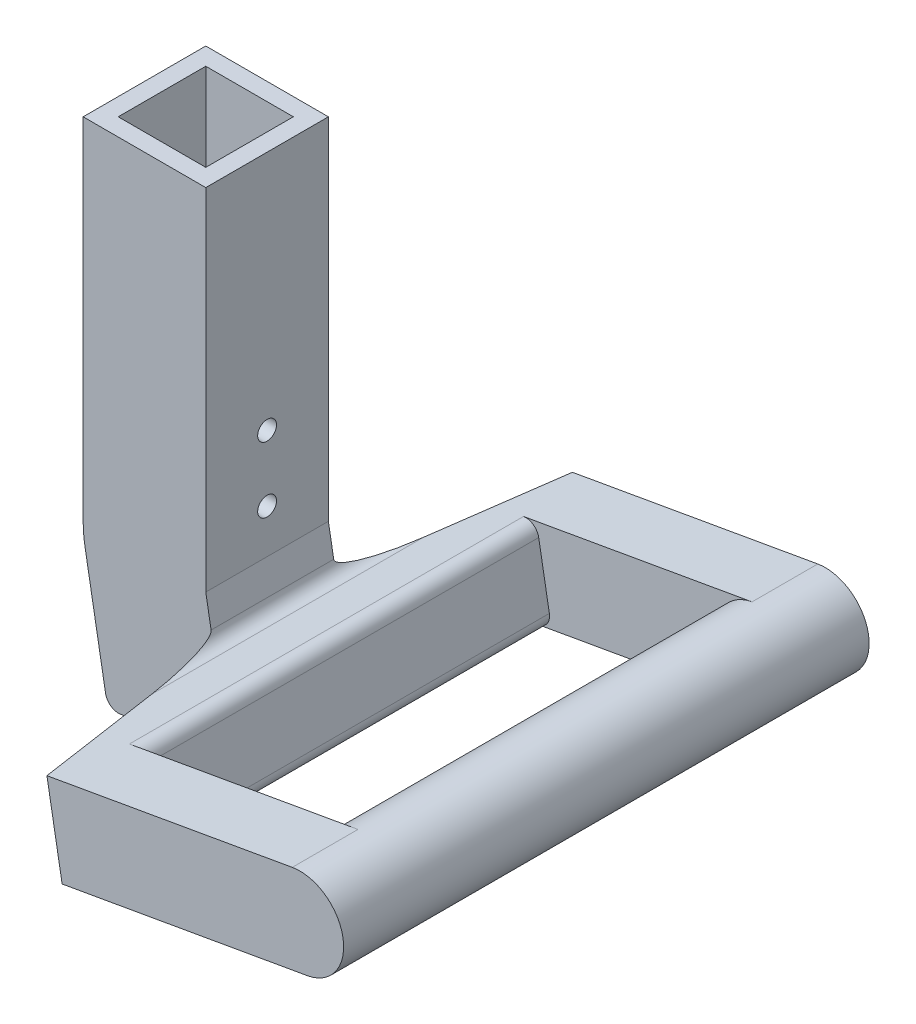
ISO-10303-21;
HEADER;
FILE_DESCRIPTION(('STEP AP214'),'2;1');
FILE_NAME('part.step','',(''),(''),'','','');
FILE_SCHEMA(('AUTOMOTIVE_DESIGN { 1 0 10303 214 1 1 1 1 }'));
ENDSEC;
DATA;
#1=APPLICATION_CONTEXT('core data for automotive mechanical design processes');
#2=APPLICATION_PROTOCOL_DEFINITION('international standard','automotive_design',2000,#1);
#3=PRODUCT_CONTEXT('',#1,'mechanical');
#4=PRODUCT('Part','Part','',(#3));
#5=PRODUCT_RELATED_PRODUCT_CATEGORY('part','',(#4));
#6=PRODUCT_DEFINITION_FORMATION('','',#4);
#7=PRODUCT_DEFINITION_CONTEXT('part definition',#1,'design');
#8=PRODUCT_DEFINITION('design','',#6,#7);
#9=PRODUCT_DEFINITION_SHAPE('','',#8);
#10=(LENGTH_UNIT() NAMED_UNIT(*) SI_UNIT(.MILLI.,.METRE.));
#11=(NAMED_UNIT(*) PLANE_ANGLE_UNIT() SI_UNIT($,.RADIAN.));
#12=(NAMED_UNIT(*) SI_UNIT($,.STERADIAN.) SOLID_ANGLE_UNIT());
#13=UNCERTAINTY_MEASURE_WITH_UNIT(LENGTH_MEASURE(1.E-05),#10,'distance_accuracy_value','');
#14=(GEOMETRIC_REPRESENTATION_CONTEXT(3) GLOBAL_UNCERTAINTY_ASSIGNED_CONTEXT((#13)) GLOBAL_UNIT_ASSIGNED_CONTEXT((#10,
#11,#12)) REPRESENTATION_CONTEXT('',''));
#15=CARTESIAN_POINT('',(0.,0.,0.));
#16=DIRECTION('',(0.,0.,1.));
#17=DIRECTION('',(1.,0.,0.));
#18=AXIS2_PLACEMENT_3D('',#15,#16,#17);
#19=CARTESIAN_POINT('',(0.,30.,0.));
#20=DIRECTION('',(1.,0.,0.));
#21=DIRECTION('',(0.,0.,-1.));
#22=AXIS2_PLACEMENT_3D('',#19,#20,#21);
#23=PLANE('',#22);
#24=CARTESIAN_POINT('',(0.,25.,-10.));
#25=DIRECTION('',(1.,0.,0.));
#26=DIRECTION('',(0.,0.,-1.));
#27=AXIS2_PLACEMENT_3D('',#24,#25,#26);
#28=CIRCLE('',#27,2.15);
#29=CARTESIAN_POINT('',(0.,25.,-12.15));
#30=VERTEX_POINT('',#29);
#31=EDGE_CURVE('E209',#30,#30,#28,.T.);
#32=ORIENTED_EDGE('',*,*,#31,.F.);
#33=EDGE_LOOP('',(#32));
#34=FACE_BOUND('',#33,.T.);
#35=CARTESIAN_POINT('',(0.,10.,-10.));
#36=DIRECTION('',(1.,0.,0.));
#37=DIRECTION('',(0.,0.,-1.));
#38=AXIS2_PLACEMENT_3D('',#35,#36,#37);
#39=CIRCLE('',#38,2.15);
#40=CARTESIAN_POINT('',(0.,10.,-12.15));
#41=VERTEX_POINT('',#40);
#42=EDGE_CURVE('E215',#41,#41,#39,.T.);
#43=ORIENTED_EDGE('',*,*,#42,.F.);
#44=EDGE_LOOP('',(#43));
#45=FACE_BOUND('',#44,.T.);
#46=DIRECTION('',(0.,-1.,0.));
#47=VECTOR('',#46,1.);
#48=CARTESIAN_POINT('',(0.,30.,0.));
#49=LINE('',#48,#47);
#50=CARTESIAN_POINT('',(0.,80.,0.));
#51=VERTEX_POINT('',#50);
#52=CARTESIAN_POINT('',(0.,3.,0.));
#53=VERTEX_POINT('',#52);
#54=EDGE_CURVE('E190',#51,#53,#49,.T.);
#55=ORIENTED_EDGE('',*,*,#54,.T.);
#56=DIRECTION('',(0.,0.,-1.));
#57=VECTOR('',#56,1.);
#58=CARTESIAN_POINT('',(0.,3.,0.));
#59=LINE('',#58,#57);
#60=CARTESIAN_POINT('',(0.,3.,-20.));
#61=VERTEX_POINT('',#60);
#62=EDGE_CURVE('E202',#53,#61,#59,.T.);
#63=ORIENTED_EDGE('',*,*,#62,.T.);
#64=DIRECTION('',(0.,-1.,0.));
#65=VECTOR('',#64,1.);
#66=CARTESIAN_POINT('',(0.,30.,-20.));
#67=LINE('',#66,#65);
#68=CARTESIAN_POINT('',(0.,80.,-20.));
#69=VERTEX_POINT('',#68);
#70=EDGE_CURVE('E199',#69,#61,#67,.T.);
#71=ORIENTED_EDGE('',*,*,#70,.F.);
#72=DIRECTION('',(0.,0.,1.));
#73=VECTOR('',#72,1.);
#74=CARTESIAN_POINT('',(0.,80.,-20.));
#75=LINE('',#74,#73);
#76=EDGE_CURVE('E335',#69,#51,#75,.T.);
#77=ORIENTED_EDGE('',*,*,#76,.T.);
#78=EDGE_LOOP('',(#55,#63,#71,#77));
#79=FACE_BOUND('',#78,.T.);
#80=ADVANCED_FACE('F34',(#34,#45,#79),#23,.T.);
#81=CARTESIAN_POINT('',(0.,30.,0.));
#82=DIRECTION('',(0.,0.,-1.));
#83=DIRECTION('',(-1.,0.,0.));
#84=AXIS2_PLACEMENT_3D('',#81,#82,#83);
#85=PLANE('',#84);
#86=DIRECTION('',(0.,-1.,0.));
#87=VECTOR('',#86,1.);
#88=CARTESIAN_POINT('',(20.,30.,0.));
#89=LINE('',#88,#87);
#90=CARTESIAN_POINT('',(20.,80.,0.));
#91=VERTEX_POINT('',#90);
#92=CARTESIAN_POINT('',(20.,3.,0.));
#93=VERTEX_POINT('',#92);
#94=EDGE_CURVE('E193',#91,#93,#89,.T.);
#95=ORIENTED_EDGE('',*,*,#94,.T.);
#96=DIRECTION('',(-1.,0.,0.));
#97=VECTOR('',#96,1.);
#98=CARTESIAN_POINT('',(0.,3.,0.));
#99=LINE('',#98,#97);
#100=EDGE_CURVE('E205',#93,#53,#99,.T.);
#101=ORIENTED_EDGE('',*,*,#100,.T.);
#102=ORIENTED_EDGE('',*,*,#54,.F.);
#103=DIRECTION('',(1.,0.,0.));
#104=VECTOR('',#103,1.);
#105=CARTESIAN_POINT('',(0.,80.,0.));
#106=LINE('',#105,#104);
#107=EDGE_CURVE('E344',#51,#91,#106,.T.);
#108=ORIENTED_EDGE('',*,*,#107,.T.);
#109=EDGE_LOOP('',(#95,#101,#102,#108));
#110=FACE_BOUND('',#109,.T.);
#111=ADVANCED_FACE('F351',(#110),#85,.T.);
#112=CARTESIAN_POINT('',(20.,30.,0.));
#113=DIRECTION('',(-1.,0.,0.));
#114=DIRECTION('',(0.,0.,1.));
#115=AXIS2_PLACEMENT_3D('',#112,#113,#114);
#116=PLANE('',#115);
#117=CARTESIAN_POINT('',(20.,25.,-10.));
#118=DIRECTION('',(-1.,0.,0.));
#119=DIRECTION('',(0.,0.,1.));
#120=AXIS2_PLACEMENT_3D('',#117,#118,#119);
#121=CIRCLE('',#120,2.15);
#122=CARTESIAN_POINT('',(20.,25.,-7.85));
#123=VERTEX_POINT('',#122);
#124=EDGE_CURVE('E212',#123,#123,#121,.T.);
#125=ORIENTED_EDGE('',*,*,#124,.F.);
#126=EDGE_LOOP('',(#125));
#127=FACE_BOUND('',#126,.T.);
#128=CARTESIAN_POINT('',(20.,10.,-10.));
#129=DIRECTION('',(-1.,0.,0.));
#130=DIRECTION('',(0.,0.,1.));
#131=AXIS2_PLACEMENT_3D('',#128,#129,#130);
#132=CIRCLE('',#131,2.15);
#133=CARTESIAN_POINT('',(20.,10.,-7.85));
#134=VERTEX_POINT('',#133);
#135=EDGE_CURVE('E218',#134,#134,#132,.T.);
#136=ORIENTED_EDGE('',*,*,#135,.F.);
#137=EDGE_LOOP('',(#136));
#138=FACE_BOUND('',#137,.T.);
#139=DIRECTION('',(0.,-1.,0.));
#140=VECTOR('',#139,1.);
#141=CARTESIAN_POINT('',(20.,30.,-20.));
#142=LINE('',#141,#140);
#143=CARTESIAN_POINT('',(20.,80.,-20.));
#144=VERTEX_POINT('',#143);
#145=CARTESIAN_POINT('',(20.,3.,-20.));
#146=VERTEX_POINT('',#145);
#147=EDGE_CURVE('E196',#144,#146,#142,.T.);
#148=ORIENTED_EDGE('',*,*,#147,.T.);
#149=DIRECTION('',(0.,0.,1.));
#150=VECTOR('',#149,1.);
#151=CARTESIAN_POINT('',(20.,3.,0.));
#152=LINE('',#151,#150);
#153=EDGE_CURVE('E83',#146,#93,#152,.T.);
#154=ORIENTED_EDGE('',*,*,#153,.T.);
#155=ORIENTED_EDGE('',*,*,#94,.F.);
#156=DIRECTION('',(0.,0.,-1.));
#157=VECTOR('',#156,1.);
#158=CARTESIAN_POINT('',(20.,80.,0.));
#159=LINE('',#158,#157);
#160=EDGE_CURVE('E341',#91,#144,#159,.T.);
#161=ORIENTED_EDGE('',*,*,#160,.T.);
#162=EDGE_LOOP('',(#148,#154,#155,#161));
#163=FACE_BOUND('',#162,.T.);
#164=ADVANCED_FACE('F362',(#127,#138,#163),#116,.T.);
#165=CARTESIAN_POINT('',(0.,30.,-20.));
#166=DIRECTION('',(0.,0.,1.));
#167=DIRECTION('',(1.,0.,0.));
#168=AXIS2_PLACEMENT_3D('',#165,#166,#167);
#169=PLANE('',#168);
#170=ORIENTED_EDGE('',*,*,#70,.T.);
#171=DIRECTION('',(1.,0.,0.));
#172=VECTOR('',#171,1.);
#173=CARTESIAN_POINT('',(0.,3.,-20.));
#174=LINE('',#173,#172);
#175=EDGE_CURVE('E170',#61,#146,#174,.T.);
#176=ORIENTED_EDGE('',*,*,#175,.T.);
#177=ORIENTED_EDGE('',*,*,#147,.F.);
#178=DIRECTION('',(-1.,0.,0.));
#179=VECTOR('',#178,1.);
#180=CARTESIAN_POINT('',(20.,80.,-20.));
#181=LINE('',#180,#179);
#182=EDGE_CURVE('E338',#144,#69,#181,.T.);
#183=ORIENTED_EDGE('',*,*,#182,.T.);
#184=EDGE_LOOP('',(#170,#176,#177,#183));
#185=FACE_BOUND('',#184,.T.);
#186=ADVANCED_FACE('F434',(#185),#169,.T.);
#187=CARTESIAN_POINT('',(-4.,30.,4.));
#188=DIRECTION('',(1.,0.,0.));
#189=DIRECTION('',(0.,0.,-1.));
#190=AXIS2_PLACEMENT_3D('',#187,#188,#189);
#191=PLANE('',#190);
#192=CARTESIAN_POINT('',(-4.,25.,-10.));
#193=DIRECTION('',(1.,0.,0.));
#194=DIRECTION('',(0.,0.,-1.));
#195=AXIS2_PLACEMENT_3D('',#192,#193,#194);
#196=CIRCLE('',#195,2.15);
#197=CARTESIAN_POINT('',(-4.,25.,-12.15));
#198=VERTEX_POINT('',#197);
#199=EDGE_CURVE('E221',#198,#198,#196,.T.);
#200=ORIENTED_EDGE('',*,*,#199,.T.);
#201=EDGE_LOOP('',(#200));
#202=FACE_BOUND('',#201,.T.);
#203=CARTESIAN_POINT('',(-4.,10.,-10.));
#204=DIRECTION('',(1.,0.,0.));
#205=DIRECTION('',(0.,0.,-1.));
#206=AXIS2_PLACEMENT_3D('',#203,#204,#205);
#207=CIRCLE('',#206,2.15);
#208=CARTESIAN_POINT('',(-4.,10.,-12.15));
#209=VERTEX_POINT('',#208);
#210=EDGE_CURVE('E225',#209,#209,#207,.T.);
#211=ORIENTED_EDGE('',*,*,#210,.T.);
#212=EDGE_LOOP('',(#211));
#213=FACE_BOUND('',#212,.T.);
#214=DIRECTION('',(0.,0.,1.));
#215=VECTOR('',#214,1.);
#216=CARTESIAN_POINT('',(-4.,0.,4.));
#217=LINE('',#216,#215);
#218=CARTESIAN_POINT('',(-4.,0.,-24.));
#219=VERTEX_POINT('',#218);
#220=CARTESIAN_POINT('',(-4.,0.,4.));
#221=VERTEX_POINT('',#220);
#222=EDGE_CURVE('E187',#219,#221,#217,.T.);
#223=ORIENTED_EDGE('',*,*,#222,.T.);
#224=DIRECTION('',(0.,-1.,0.));
#225=VECTOR('',#224,1.);
#226=CARTESIAN_POINT('',(-4.,30.,4.));
#227=LINE('',#226,#225);
#228=CARTESIAN_POINT('',(-4.,80.,4.));
#229=VERTEX_POINT('',#228);
#230=EDGE_CURVE('E172',#229,#221,#227,.T.);
#231=ORIENTED_EDGE('',*,*,#230,.F.);
#232=DIRECTION('',(0.,0.,1.));
#233=VECTOR('',#232,1.);
#234=CARTESIAN_POINT('',(-4.,80.,-24.));
#235=LINE('',#234,#233);
#236=CARTESIAN_POINT('',(-4.,80.,-24.));
#237=VERTEX_POINT('',#236);
#238=EDGE_CURVE('E329',#237,#229,#235,.T.);
#239=ORIENTED_EDGE('',*,*,#238,.F.);
#240=DIRECTION('',(0.,-1.,0.));
#241=VECTOR('',#240,1.);
#242=CARTESIAN_POINT('',(-4.,30.,-24.));
#243=LINE('',#242,#241);
#244=EDGE_CURVE('E181',#237,#219,#243,.T.);
#245=ORIENTED_EDGE('',*,*,#244,.T.);
#246=EDGE_LOOP('',(#223,#231,#239,#245));
#247=FACE_BOUND('',#246,.T.);
#248=ADVANCED_FACE('F436',(#202,#213,#247),#191,.F.);
#249=CARTESIAN_POINT('',(-4.,30.,4.));
#250=DIRECTION('',(0.,0.,-1.));
#251=DIRECTION('',(-1.,0.,0.));
#252=AXIS2_PLACEMENT_3D('',#249,#250,#251);
#253=PLANE('',#252);
#254=DIRECTION('',(0.173648177666932,-0.984807753012208,0.));
#255=VECTOR('',#254,1.);
#256=CARTESIAN_POINT('',(1.63482824566612,-34.4063815650403,4.));
#257=LINE('',#256,#255);
#258=CARTESIAN_POINT('',(-3.57461708434183,-4.86214897467408,4.));
#259=VERTEX_POINT('',#258);
#260=CARTESIAN_POINT('',(1.11388371266532,-31.4519583060037,4.));
#261=VERTEX_POINT('',#260);
#262=EDGE_CURVE('E241',#259,#261,#257,.T.);
#263=ORIENTED_EDGE('',*,*,#262,.T.);
#264=CARTESIAN_POINT('',(4.06830697170194,-30.9310137730029,4.));
#265=DIRECTION('',(0.,0.,-1.));
#266=DIRECTION('',(-1.,0.,0.));
#267=AXIS2_PLACEMENT_3D('',#264,#265,#266);
#268=CIRCLE('',#267,3.);
#269=CARTESIAN_POINT('',(4.58925150470274,-33.8854370320395,4.));
#270=VERTEX_POINT('',#269);
#271=EDGE_CURVE('E157',#261,#270,#268,.F.);
#272=ORIENTED_EDGE('',*,*,#271,.T.);
#273=DIRECTION('',(0.984807753012208,0.173648177666932,0.));
#274=VECTOR('',#273,1.);
#275=CARTESIAN_POINT('',(29.2094453300079,-29.5442325903662,4.));
#276=LINE('',#275,#274);
#277=CARTESIAN_POINT('',(29.2094453300079,-29.5442325903662,4.));
#278=VERTEX_POINT('',#277);
#279=EDGE_CURVE('E249',#270,#278,#276,.T.);
#280=ORIENTED_EDGE('',*,*,#279,.T.);
#281=DIRECTION('',(-0.173648177666931,0.984807753012208,0.));
#282=VECTOR('',#281,1.);
#283=CARTESIAN_POINT('',(24.,0.,4.));
#284=LINE('',#283,#282);
#285=CARTESIAN_POINT('',(25.2155372436685,-6.89365427108546,4.));
#286=VERTEX_POINT('',#285);
#287=EDGE_CURVE('E49',#278,#286,#284,.T.);
#288=ORIENTED_EDGE('',*,*,#287,.T.);
#289=CARTESIAN_POINT('',(24.,0.,4.));
#290=VERTEX_POINT('',#289);
#291=EDGE_CURVE('E248',#286,#290,#284,.T.);
#292=ORIENTED_EDGE('',*,*,#291,.T.);
#293=DIRECTION('',(0.,-1.,0.));
#294=VECTOR('',#293,1.);
#295=CARTESIAN_POINT('',(24.,30.,4.));
#296=LINE('',#295,#294);
#297=CARTESIAN_POINT('',(24.,80.,4.));
#298=VERTEX_POINT('',#297);
#299=EDGE_CURVE('E175',#298,#290,#296,.T.);
#300=ORIENTED_EDGE('',*,*,#299,.F.);
#301=DIRECTION('',(1.,0.,0.));
#302=VECTOR('',#301,1.);
#303=CARTESIAN_POINT('',(-4.,80.,4.));
#304=LINE('',#303,#302);
#305=EDGE_CURVE('E326',#229,#298,#304,.T.);
#306=ORIENTED_EDGE('',*,*,#305,.F.);
#307=ORIENTED_EDGE('',*,*,#230,.T.);
#308=CARTESIAN_POINT('',(24.,0.,4.));
#309=DIRECTION('',(0.,0.,1.));
#310=DIRECTION('',(1.,0.,0.));
#311=AXIS2_PLACEMENT_3D('',#308,#309,#310);
#312=CIRCLE('',#311,28.);
#313=EDGE_CURVE('E244',#221,#259,#312,.T.);
#314=ORIENTED_EDGE('',*,*,#313,.T.);
#315=EDGE_LOOP('',(#263,#272,#280,#288,#292,#300,#306,#307,#314));
#316=FACE_BOUND('',#315,.T.);
#317=ADVANCED_FACE('F442',(#316),#253,.F.);
#318=CARTESIAN_POINT('',(24.,30.,4.));
#319=DIRECTION('',(-1.,0.,0.));
#320=DIRECTION('',(0.,0.,1.));
#321=AXIS2_PLACEMENT_3D('',#318,#319,#320);
#322=PLANE('',#321);
#323=CARTESIAN_POINT('',(24.,25.,-10.));
#324=DIRECTION('',(1.,0.,0.));
#325=DIRECTION('',(0.,0.,-1.));
#326=AXIS2_PLACEMENT_3D('',#323,#324,#325);
#327=CIRCLE('',#326,2.15);
#328=CARTESIAN_POINT('',(24.,25.,-12.15));
#329=VERTEX_POINT('',#328);
#330=EDGE_CURVE('E229',#329,#329,#327,.T.);
#331=ORIENTED_EDGE('',*,*,#330,.F.);
#332=EDGE_LOOP('',(#331));
#333=FACE_BOUND('',#332,.T.);
#334=CARTESIAN_POINT('',(24.,10.,-10.));
#335=DIRECTION('',(1.,0.,0.));
#336=DIRECTION('',(0.,0.,-1.));
#337=AXIS2_PLACEMENT_3D('',#334,#335,#336);
#338=CIRCLE('',#337,2.15);
#339=CARTESIAN_POINT('',(24.,10.,-12.15));
#340=VERTEX_POINT('',#339);
#341=EDGE_CURVE('E222',#340,#340,#338,.T.);
#342=ORIENTED_EDGE('',*,*,#341,.F.);
#343=EDGE_LOOP('',(#342));
#344=FACE_BOUND('',#343,.T.);
#345=DIRECTION('',(0.,0.,-1.));
#346=VECTOR('',#345,1.);
#347=CARTESIAN_POINT('',(24.,0.,4.));
#348=LINE('',#347,#346);
#349=CARTESIAN_POINT('',(24.,0.,-24.));
#350=VERTEX_POINT('',#349);
#351=EDGE_CURVE('E184',#290,#350,#348,.T.);
#352=ORIENTED_EDGE('',*,*,#351,.T.);
#353=DIRECTION('',(0.,-1.,0.));
#354=VECTOR('',#353,1.);
#355=CARTESIAN_POINT('',(24.,30.,-24.));
#356=LINE('',#355,#354);
#357=CARTESIAN_POINT('',(24.,80.,-24.));
#358=VERTEX_POINT('',#357);
#359=EDGE_CURVE('E178',#358,#350,#356,.T.);
#360=ORIENTED_EDGE('',*,*,#359,.F.);
#361=DIRECTION('',(0.,0.,-1.));
#362=VECTOR('',#361,1.);
#363=CARTESIAN_POINT('',(24.,80.,4.));
#364=LINE('',#363,#362);
#365=EDGE_CURVE('E323',#298,#358,#364,.T.);
#366=ORIENTED_EDGE('',*,*,#365,.F.);
#367=ORIENTED_EDGE('',*,*,#299,.T.);
#368=EDGE_LOOP('',(#352,#360,#366,#367));
#369=FACE_BOUND('',#368,.T.);
#370=ADVANCED_FACE('F461',(#333,#344,#369),#322,.F.);
#371=CARTESIAN_POINT('',(-4.,30.,-24.));
#372=DIRECTION('',(0.,0.,1.));
#373=DIRECTION('',(1.,0.,0.));
#374=AXIS2_PLACEMENT_3D('',#371,#372,#373);
#375=PLANE('',#374);
#376=DIRECTION('',(-0.984807753012208,-0.173648177666932,0.));
#377=VECTOR('',#376,1.);
#378=CARTESIAN_POINT('',(29.2094453300079,-29.5442325903662,-24.));
#379=LINE('',#378,#377);
#380=CARTESIAN_POINT('',(29.2094453300079,-29.5442325903662,-24.));
#381=VERTEX_POINT('',#380);
#382=CARTESIAN_POINT('',(4.58925150470274,-33.8854370320395,-24.));
#383=VERTEX_POINT('',#382);
#384=EDGE_CURVE('E236',#381,#383,#379,.T.);
#385=ORIENTED_EDGE('',*,*,#384,.T.);
#386=CARTESIAN_POINT('',(4.06830697170194,-30.9310137730029,-24.));
#387=DIRECTION('',(0.,0.,1.));
#388=DIRECTION('',(1.,0.,0.));
#389=AXIS2_PLACEMENT_3D('',#386,#387,#388);
#390=CIRCLE('',#389,3.);
#391=CARTESIAN_POINT('',(1.11388371266532,-31.4519583060037,-24.));
#392=VERTEX_POINT('',#391);
#393=EDGE_CURVE('E152',#383,#392,#390,.F.);
#394=ORIENTED_EDGE('',*,*,#393,.T.);
#395=DIRECTION('',(-0.173648177666932,0.984807753012208,0.));
#396=VECTOR('',#395,1.);
#397=CARTESIAN_POINT('',(1.63482824566612,-34.4063815650403,-24.));
#398=LINE('',#397,#396);
#399=CARTESIAN_POINT('',(-3.57461708434183,-4.86214897467408,-24.));
#400=VERTEX_POINT('',#399);
#401=EDGE_CURVE('E253',#392,#400,#398,.T.);
#402=ORIENTED_EDGE('',*,*,#401,.T.);
#403=CARTESIAN_POINT('',(24.,0.,-24.));
#404=DIRECTION('',(0.,0.,1.));
#405=DIRECTION('',(1.,0.,0.));
#406=AXIS2_PLACEMENT_3D('',#403,#404,#405);
#407=CIRCLE('',#406,28.);
#408=EDGE_CURVE('E240',#400,#219,#407,.F.);
#409=ORIENTED_EDGE('',*,*,#408,.T.);
#410=ORIENTED_EDGE('',*,*,#244,.F.);
#411=DIRECTION('',(-1.,0.,0.));
#412=VECTOR('',#411,1.);
#413=CARTESIAN_POINT('',(24.,80.,-24.));
#414=LINE('',#413,#412);
#415=EDGE_CURVE('E332',#358,#237,#414,.T.);
#416=ORIENTED_EDGE('',*,*,#415,.F.);
#417=ORIENTED_EDGE('',*,*,#359,.T.);
#418=DIRECTION('',(0.173648177666931,-0.984807753012208,0.));
#419=VECTOR('',#418,1.);
#420=CARTESIAN_POINT('',(24.,0.,-24.));
#421=LINE('',#420,#419);
#422=CARTESIAN_POINT('',(25.2155372436685,-6.89365427108547,-24.));
#423=VERTEX_POINT('',#422);
#424=EDGE_CURVE('E226',#350,#423,#421,.T.);
#425=ORIENTED_EDGE('',*,*,#424,.T.);
#426=DIRECTION('',(0.173648177666932,-0.984807753012208,0.));
#427=VECTOR('',#426,1.);
#428=CARTESIAN_POINT('',(25.7364817766693,-9.84807753012208,-24.));
#429=LINE('',#428,#427);
#430=EDGE_CURVE('E72',#423,#381,#429,.T.);
#431=ORIENTED_EDGE('',*,*,#430,.T.);
#432=EDGE_LOOP('',(#385,#394,#402,#409,#410,#416,#417,#425,#431));
#433=FACE_BOUND('',#432,.T.);
#434=ADVANCED_FACE('F458',(#433),#375,.F.);
#435=CARTESIAN_POINT('',(0.,3.,0.));
#436=DIRECTION('',(0.,-1.,0.));
#437=DIRECTION('',(0.,0.,-1.));
#438=AXIS2_PLACEMENT_3D('',#435,#436,#437);
#439=PLANE('',#438);
#440=ORIENTED_EDGE('',*,*,#62,.F.);
#441=ORIENTED_EDGE('',*,*,#100,.F.);
#442=ORIENTED_EDGE('',*,*,#153,.F.);
#443=ORIENTED_EDGE('',*,*,#175,.F.);
#444=EDGE_LOOP('',(#440,#441,#442,#443));
#445=FACE_BOUND('',#444,.T.);
#446=ADVANCED_FACE('F432',(#445),#439,.F.);
#447=CARTESIAN_POINT('',(-4.,10.,-10.));
#448=DIRECTION('',(1.,0.,0.));
#449=DIRECTION('',(0.,0.,-1.));
#450=AXIS2_PLACEMENT_3D('',#447,#448,#449);
#451=CYLINDRICAL_SURFACE('',#450,2.15);
#452=ORIENTED_EDGE('',*,*,#135,.T.);
#453=EDGE_LOOP('',(#452));
#454=FACE_BOUND('',#453,.T.);
#455=ORIENTED_EDGE('',*,*,#341,.T.);
#456=EDGE_LOOP('',(#455));
#457=FACE_BOUND('',#456,.T.);
#458=ADVANCED_FACE('F554',(#454,#457),#451,.F.);
#459=CARTESIAN_POINT('',(-4.,25.,-10.));
#460=DIRECTION('',(1.,0.,0.));
#461=DIRECTION('',(0.,0.,-1.));
#462=AXIS2_PLACEMENT_3D('',#459,#460,#461);
#463=CYLINDRICAL_SURFACE('',#462,2.15);
#464=ORIENTED_EDGE('',*,*,#124,.T.);
#465=EDGE_LOOP('',(#464));
#466=FACE_BOUND('',#465,.T.);
#467=ORIENTED_EDGE('',*,*,#330,.T.);
#468=EDGE_LOOP('',(#467));
#469=FACE_BOUND('',#468,.T.);
#470=ADVANCED_FACE('F550',(#466,#469),#463,.F.);
#471=ORIENTED_EDGE('',*,*,#42,.T.);
#472=EDGE_LOOP('',(#471));
#473=FACE_BOUND('',#472,.T.);
#474=ORIENTED_EDGE('',*,*,#210,.F.);
#475=EDGE_LOOP('',(#474));
#476=FACE_BOUND('',#475,.T.);
#477=ADVANCED_FACE('F553',(#473,#476),#451,.F.);
#478=ORIENTED_EDGE('',*,*,#31,.T.);
#479=EDGE_LOOP('',(#478));
#480=FACE_BOUND('',#479,.T.);
#481=ORIENTED_EDGE('',*,*,#199,.F.);
#482=EDGE_LOOP('',(#481));
#483=FACE_BOUND('',#482,.T.);
#484=ADVANCED_FACE('F549',(#480,#483),#463,.F.);
#485=CARTESIAN_POINT('',(29.2094453300079,-29.5442325903662,-71.8191002793437));
#486=DIRECTION('',(0.173648177666932,-0.984807753012208,0.));
#487=DIRECTION('',(0.984807753012208,0.173648177666932,0.));
#488=AXIS2_PLACEMENT_3D('',#485,#486,#487);
#489=PLANE('',#488);
#490=ORIENTED_EDGE('',*,*,#279,.F.);
#491=DIRECTION('',(0.,0.,1.));
#492=VECTOR('',#491,1.);
#493=CARTESIAN_POINT('',(4.58925150470274,-33.8854370320395,-71.8191002793437));
#494=LINE('',#493,#492);
#495=EDGE_CURVE('E154',#270,#383,#494,.F.);
#496=ORIENTED_EDGE('',*,*,#495,.T.);
#497=ORIENTED_EDGE('',*,*,#384,.F.);
#498=DIRECTION('',(0.171010071662831,0.0301536896070455,-0.984807753012208));
#499=VECTOR('',#498,1.);
#500=CARTESIAN_POINT('',(37.1972615026866,-28.1357650821836,-70.));
#501=LINE('',#500,#499);
#502=CARTESIAN_POINT('',(37.1972615026866,-28.1357650821836,-70.));
#503=VERTEX_POINT('',#502);
#504=EDGE_CURVE('E287',#381,#503,#501,.T.);
#505=ORIENTED_EDGE('',*,*,#504,.T.);
#506=DIRECTION('',(0.984807753012208,0.173648177666932,0.));
#507=VECTOR('',#506,1.);
#508=CARTESIAN_POINT('',(93.2219492758014,-18.2571010420157,-70.));
#509=LINE('',#508,#507);
#510=CARTESIAN_POINT('',(93.2219492758014,-18.2571010420157,-70.));
#511=VERTEX_POINT('',#510);
#512=EDGE_CURVE('E284',#503,#511,#509,.T.);
#513=ORIENTED_EDGE('',*,*,#512,.T.);
#514=DIRECTION('',(0.,0.,1.));
#515=VECTOR('',#514,1.);
#516=CARTESIAN_POINT('',(93.2219492758014,-18.2571010420157,-55.));
#517=LINE('',#516,#515);
#518=CARTESIAN_POINT('',(93.2219492758014,-18.2571010420157,-55.));
#519=VERTEX_POINT('',#518);
#520=EDGE_CURVE('E281',#511,#519,#517,.T.);
#521=ORIENTED_EDGE('',*,*,#520,.T.);
#522=DIRECTION('',(-0.984807753012208,-0.173648177666932,0.));
#523=VECTOR('',#522,1.);
#524=CARTESIAN_POINT('',(43.9815616251911,-26.9395099253623,-55.));
#525=LINE('',#524,#523);
#526=CARTESIAN_POINT('',(41.0271383661544,-27.4604544583631,-55.));
#527=VERTEX_POINT('',#526);
#528=EDGE_CURVE('E279',#519,#527,#525,.T.);
#529=ORIENTED_EDGE('',*,*,#528,.T.);
#530=DIRECTION('',(0.,0.,1.));
#531=VECTOR('',#530,1.);
#532=CARTESIAN_POINT('',(41.0271383661544,-27.4604544583631,-71.8191002793437));
#533=LINE('',#532,#531);
#534=CARTESIAN_POINT('',(41.0271383661544,-27.4604544583631,35.));
#535=VERTEX_POINT('',#534);
#536=EDGE_CURVE('E142',#527,#535,#533,.T.);
#537=ORIENTED_EDGE('',*,*,#536,.T.);
#538=DIRECTION('',(0.984807753012208,0.173648177666932,0.));
#539=VECTOR('',#538,1.);
#540=CARTESIAN_POINT('',(93.2219492758014,-18.2571010420157,35.));
#541=LINE('',#540,#539);
#542=CARTESIAN_POINT('',(93.2219492758014,-18.2571010420157,35.));
#543=VERTEX_POINT('',#542);
#544=EDGE_CURVE('E276',#535,#543,#541,.T.);
#545=ORIENTED_EDGE('',*,*,#544,.T.);
#546=DIRECTION('',(0.,0.,1.));
#547=VECTOR('',#546,1.);
#548=CARTESIAN_POINT('',(93.2219492758014,-18.2571010420157,50.));
#549=LINE('',#548,#547);
#550=CARTESIAN_POINT('',(93.2219492758014,-18.2571010420157,50.));
#551=VERTEX_POINT('',#550);
#552=EDGE_CURVE('E273',#543,#551,#549,.T.);
#553=ORIENTED_EDGE('',*,*,#552,.T.);
#554=DIRECTION('',(-0.984807753012208,-0.173648177666932,0.));
#555=VECTOR('',#554,1.);
#556=CARTESIAN_POINT('',(37.1972615026866,-28.1357650821836,50.));
#557=LINE('',#556,#555);
#558=CARTESIAN_POINT('',(37.1972615026866,-28.1357650821836,50.));
#559=VERTEX_POINT('',#558);
#560=EDGE_CURVE('E270',#551,#559,#557,.T.);
#561=ORIENTED_EDGE('',*,*,#560,.T.);
#562=DIRECTION('',(-0.171010071662831,-0.0301536896070454,-0.984807753012209));
#563=VECTOR('',#562,1.);
#564=CARTESIAN_POINT('',(29.2094453300079,-29.5442325903662,4.));
#565=LINE('',#564,#563);
#566=EDGE_CURVE('E266',#559,#278,#565,.T.);
#567=ORIENTED_EDGE('',*,*,#566,.T.);
#568=EDGE_LOOP('',(#490,#496,#497,#505,#513,#521,#529,#537,#545,#553,#561,#567));
#569=FACE_BOUND('',#568,.T.);
#570=ADVANCED_FACE('F492',(#569),#489,.T.);
#571=CARTESIAN_POINT('',(1.63482824566612,-34.4063815650403,-71.8191002793437));
#572=DIRECTION('',(-0.984807753012208,-0.173648177666932,0.));
#573=DIRECTION('',(0.173648177666932,-0.984807753012208,0.));
#574=AXIS2_PLACEMENT_3D('',#571,#572,#573);
#575=PLANE('',#574);
#576=ORIENTED_EDGE('',*,*,#401,.F.);
#577=DIRECTION('',(0.,0.,1.));
#578=VECTOR('',#577,1.);
#579=CARTESIAN_POINT('',(1.11388371266532,-31.4519583060037,-71.8191002793437));
#580=LINE('',#579,#578);
#581=EDGE_CURVE('E159',#392,#261,#580,.T.);
#582=ORIENTED_EDGE('',*,*,#581,.T.);
#583=ORIENTED_EDGE('',*,*,#262,.F.);
#584=DIRECTION('',(0.,0.,1.));
#585=VECTOR('',#584,1.);
#586=CARTESIAN_POINT('',(-3.57461708434183,-4.86214897467408,-71.8191002793437));
#587=LINE('',#586,#585);
#588=EDGE_CURVE('E237',#400,#259,#587,.T.);
#589=ORIENTED_EDGE('',*,*,#588,.F.);
#590=EDGE_LOOP('',(#576,#582,#583,#589));
#591=FACE_BOUND('',#590,.T.);
#592=ADVANCED_FACE('F522',(#591),#575,.T.);
#593=CARTESIAN_POINT('',(24.,0.,-71.8191002793437));
#594=DIRECTION('',(0.,0.,1.));
#595=DIRECTION('',(1.,0.,0.));
#596=AXIS2_PLACEMENT_3D('',#593,#594,#595);
#597=CYLINDRICAL_SURFACE('',#596,28.);
#598=ORIENTED_EDGE('',*,*,#408,.F.);
#599=ORIENTED_EDGE('',*,*,#588,.T.);
#600=ORIENTED_EDGE('',*,*,#313,.F.);
#601=ORIENTED_EDGE('',*,*,#222,.F.);
#602=EDGE_LOOP('',(#598,#599,#600,#601));
#603=FACE_BOUND('',#602,.T.);
#604=ADVANCED_FACE('F525',(#603),#597,.T.);
#605=CARTESIAN_POINT('',(24.,0.,-71.8191002793437));
#606=DIRECTION('',(0.984807753012208,0.173648177666931,0.));
#607=DIRECTION('',(-0.173648177666931,0.984807753012208,0.));
#608=AXIS2_PLACEMENT_3D('',#605,#606,#607);
#609=PLANE('',#608);
#610=ORIENTED_EDGE('',*,*,#291,.F.);
#611=DIRECTION('',(0.,0.,-1.));
#612=VECTOR('',#611,1.);
#613=CARTESIAN_POINT('',(25.2155372436685,-6.89365427108546,-24.));
#614=LINE('',#613,#612);
#615=EDGE_CURVE('E167',#286,#423,#614,.T.);
#616=ORIENTED_EDGE('',*,*,#615,.T.);
#617=ORIENTED_EDGE('',*,*,#424,.F.);
#618=ORIENTED_EDGE('',*,*,#351,.F.);
#619=EDGE_LOOP('',(#610,#616,#617,#618));
#620=FACE_BOUND('',#619,.T.);
#621=ADVANCED_FACE('F536',(#620),#609,.T.);
#622=CARTESIAN_POINT('',(33.7242979493479,-8.4396100219394,-70.));
#623=DIRECTION('',(-0.969846310392954,-0.171010071662836,-0.173648177666927));
#624=DIRECTION('',(-0.176244384228248,0.,0.984346441568214));
#625=AXIS2_PLACEMENT_3D('',#622,#623,#624);
#626=PLANE('',#625);
#627=ORIENTED_EDGE('',*,*,#504,.F.);
#628=ORIENTED_EDGE('',*,*,#430,.F.);
#629=CARTESIAN_POINT('',(28.1699605027051,-6.37270973808467,-41.0138454588535));
#630=DIRECTION('',(-0.969846310392954,-0.171010071662836,-0.173648177666927));
#631=DIRECTION('',(-0.171010071662831,-0.0301536896070455,0.984807753012209));
#632=AXIS2_PLACEMENT_3D('',#629,#630,#631);
#633=ELLIPSE('',#632,17.2763114494312,3.);
#634=CARTESIAN_POINT('',(28.6909050357059,-9.32713299712129,-41.0138454588535));
#635=VERTEX_POINT('',#634);
#636=EDGE_CURVE('E128',#423,#635,#633,.F.);
#637=ORIENTED_EDGE('',*,*,#636,.T.);
#638=DIRECTION('',(0.171010071662831,0.0301536896070455,-0.984807753012208));
#639=VECTOR('',#638,1.);
#640=CARTESIAN_POINT('',(33.7242979493479,-8.4396100219394,-70.));
#641=LINE('',#640,#639);
#642=CARTESIAN_POINT('',(33.7242979493479,-8.4396100219394,-70.));
#643=VERTEX_POINT('',#642);
#644=EDGE_CURVE('E269',#635,#643,#641,.T.);
#645=ORIENTED_EDGE('',*,*,#644,.T.);
#646=DIRECTION('',(0.173648177666932,-0.984807753012208,0.));
#647=VECTOR('',#646,1.);
#648=CARTESIAN_POINT('',(33.7242979493479,-8.4396100219394,-70.));
#649=LINE('',#648,#647);
#650=EDGE_CURVE('E138',#643,#503,#649,.T.);
#651=ORIENTED_EDGE('',*,*,#650,.T.);
#652=EDGE_LOOP('',(#627,#628,#637,#645,#651));
#653=FACE_BOUND('',#652,.T.);
#654=ADVANCED_FACE('F504',(#653),#626,.T.);
#655=CARTESIAN_POINT('',(25.7364817766693,-9.84807753012208,4.));
#656=DIRECTION('',(-0.969846310392955,-0.171010071662836,0.173648177666927));
#657=DIRECTION('',(0.176244384228248,0.,0.984346441568214));
#658=AXIS2_PLACEMENT_3D('',#655,#656,#657);
#659=PLANE('',#658);
#660=ORIENTED_EDGE('',*,*,#566,.F.);
#661=DIRECTION('',(0.173648177666932,-0.984807753012208,0.));
#662=VECTOR('',#661,1.);
#663=CARTESIAN_POINT('',(33.7242979493479,-8.4396100219394,50.));
#664=LINE('',#663,#662);
#665=CARTESIAN_POINT('',(33.7242979493479,-8.4396100219394,50.));
#666=VERTEX_POINT('',#665);
#667=EDGE_CURVE('E262',#666,#559,#664,.T.);
#668=ORIENTED_EDGE('',*,*,#667,.F.);
#669=DIRECTION('',(-0.171010071662831,-0.0301536896070454,-0.984807753012209));
#670=VECTOR('',#669,1.);
#671=CARTESIAN_POINT('',(25.7364817766693,-9.84807753012208,4.));
#672=LINE('',#671,#670);
#673=CARTESIAN_POINT('',(28.6909050357059,-9.32713299712129,21.0138454588535));
#674=VERTEX_POINT('',#673);
#675=EDGE_CURVE('E259',#666,#674,#672,.T.);
#676=ORIENTED_EDGE('',*,*,#675,.T.);
#677=CARTESIAN_POINT('',(28.1699605027051,-6.37270973808467,21.0138454588535));
#678=DIRECTION('',(-0.969846310392955,-0.171010071662836,0.173648177666927));
#679=DIRECTION('',(0.171010071662831,0.0301536896070455,0.984807753012209));
#680=AXIS2_PLACEMENT_3D('',#677,#678,#679);
#681=ELLIPSE('',#680,17.2763114494312,3.);
#682=EDGE_CURVE('E145',#674,#286,#681,.F.);
#683=ORIENTED_EDGE('',*,*,#682,.T.);
#684=ORIENTED_EDGE('',*,*,#287,.F.);
#685=EDGE_LOOP('',(#660,#668,#676,#683,#684));
#686=FACE_BOUND('',#685,.T.);
#687=ADVANCED_FACE('F511',(#686),#659,.T.);
#688=CARTESIAN_POINT('',(33.7242979493479,-8.4396100219394,50.));
#689=DIRECTION('',(0.,0.,1.));
#690=DIRECTION('',(1.,0.,0.));
#691=AXIS2_PLACEMENT_3D('',#688,#689,#690);
#692=PLANE('',#691);
#693=ORIENTED_EDGE('',*,*,#560,.F.);
#694=CARTESIAN_POINT('',(91.4854674991322,-8.40902351189359,50.));
#695=DIRECTION('',(0.,0.,1.));
#696=DIRECTION('',(1.,0.,0.));
#697=AXIS2_PLACEMENT_3D('',#694,#695,#696);
#698=CIRCLE('',#697,10.);
#699=CARTESIAN_POINT('',(89.7489857224628,1.43905401822848,50.));
#700=VERTEX_POINT('',#699);
#701=EDGE_CURVE('E317',#551,#700,#698,.T.);
#702=ORIENTED_EDGE('',*,*,#701,.T.);
#703=DIRECTION('',(-0.984807753012208,-0.173648177666932,0.));
#704=VECTOR('',#703,1.);
#705=CARTESIAN_POINT('',(33.7242979493479,-8.4396100219394,50.));
#706=LINE('',#705,#704);
#707=EDGE_CURVE('E293',#700,#666,#706,.T.);
#708=ORIENTED_EDGE('',*,*,#707,.T.);
#709=ORIENTED_EDGE('',*,*,#667,.T.);
#710=EDGE_LOOP('',(#693,#702,#708,#709));
#711=FACE_BOUND('',#710,.T.);
#712=ADVANCED_FACE('F513',(#711),#692,.T.);
#713=CARTESIAN_POINT('',(89.7489857224628,1.43905401822848,35.));
#714=DIRECTION('',(0.,0.,-1.));
#715=DIRECTION('',(-1.,0.,0.));
#716=AXIS2_PLACEMENT_3D('',#713,#714,#715);
#717=PLANE('',#716);
#718=DIRECTION('',(0.984807753012208,0.173648177666932,0.));
#719=VECTOR('',#718,1.);
#720=CARTESIAN_POINT('',(89.7489857224628,1.43905401822848,35.));
#721=LINE('',#720,#719);
#722=CARTESIAN_POINT('',(37.5541748128158,-7.76429939811891,35.));
#723=VERTEX_POINT('',#722);
#724=CARTESIAN_POINT('',(89.7489857224628,1.43905401822848,35.));
#725=VERTEX_POINT('',#724);
#726=EDGE_CURVE('E299',#723,#725,#721,.T.);
#727=ORIENTED_EDGE('',*,*,#726,.T.);
#728=CARTESIAN_POINT('',(91.4854674991322,-8.40902351189359,35.));
#729=DIRECTION('',(0.,0.,-1.));
#730=DIRECTION('',(-1.,0.,0.));
#731=AXIS2_PLACEMENT_3D('',#728,#729,#730);
#732=CIRCLE('',#731,10.);
#733=EDGE_CURVE('E314',#725,#543,#732,.F.);
#734=ORIENTED_EDGE('',*,*,#733,.T.);
#735=ORIENTED_EDGE('',*,*,#544,.F.);
#736=CARTESIAN_POINT('',(40.5061938331536,-24.5060311993264,35.));
#737=DIRECTION('',(0.,0.,-1.));
#738=DIRECTION('',(-1.,0.,0.));
#739=AXIS2_PLACEMENT_3D('',#736,#737,#738);
#740=CIRCLE('',#739,3.);
#741=CARTESIAN_POINT('',(43.4606170921903,-23.9850866663256,35.));
#742=VERTEX_POINT('',#741);
#743=EDGE_CURVE('E58',#535,#742,#740,.F.);
#744=ORIENTED_EDGE('',*,*,#743,.T.);
#745=DIRECTION('',(0.173648177666932,-0.984807753012208,0.));
#746=VECTOR('',#745,1.);
#747=CARTESIAN_POINT('',(40.5085980718524,-7.24335486511811,35.));
#748=LINE('',#747,#746);
#749=CARTESIAN_POINT('',(41.0295426048532,-10.1977781241547,35.));
#750=VERTEX_POINT('',#749);
#751=EDGE_CURVE('E125',#750,#742,#748,.T.);
#752=ORIENTED_EDGE('',*,*,#751,.F.);
#753=CARTESIAN_POINT('',(38.0751193458166,-10.7187226571555,35.));
#754=DIRECTION('',(0.,0.,-1.));
#755=DIRECTION('',(-1.,0.,0.));
#756=AXIS2_PLACEMENT_3D('',#753,#754,#755);
#757=CIRCLE('',#756,3.);
#758=EDGE_CURVE('E42',#750,#723,#757,.F.);
#759=ORIENTED_EDGE('',*,*,#758,.T.);
#760=EDGE_LOOP('',(#727,#734,#735,#744,#752,#759));
#761=FACE_BOUND('',#760,.T.);
#762=ADVANCED_FACE('F483',(#761),#717,.T.);
#763=CARTESIAN_POINT('',(40.5085980718524,-7.24335486511811,35.));
#764=DIRECTION('',(0.984807753012208,0.173648177666932,0.));
#765=DIRECTION('',(-0.173648177666932,0.984807753012208,0.));
#766=AXIS2_PLACEMENT_3D('',#763,#764,#765);
#767=PLANE('',#766);
#768=ORIENTED_EDGE('',*,*,#751,.T.);
#769=DIRECTION('',(0.,0.,1.));
#770=VECTOR('',#769,1.);
#771=CARTESIAN_POINT('',(43.4606170921903,-23.9850866663256,35.));
#772=LINE('',#771,#770);
#773=CARTESIAN_POINT('',(43.4606170921903,-23.9850866663256,-55.));
#774=VERTEX_POINT('',#773);
#775=EDGE_CURVE('E119',#742,#774,#772,.F.);
#776=ORIENTED_EDGE('',*,*,#775,.T.);
#777=DIRECTION('',(0.173648177666932,-0.984807753012208,0.));
#778=VECTOR('',#777,1.);
#779=CARTESIAN_POINT('',(40.5085980718524,-7.24335486511811,-55.));
#780=LINE('',#779,#778);
#781=CARTESIAN_POINT('',(41.0295426048532,-10.1977781241547,-55.));
#782=VERTEX_POINT('',#781);
#783=EDGE_CURVE('E123',#782,#774,#780,.T.);
#784=ORIENTED_EDGE('',*,*,#783,.F.);
#785=DIRECTION('',(0.,0.,1.));
#786=VECTOR('',#785,1.);
#787=CARTESIAN_POINT('',(41.0295426048532,-10.1977781241547,35.));
#788=LINE('',#787,#786);
#789=EDGE_CURVE('E129',#782,#750,#788,.T.);
#790=ORIENTED_EDGE('',*,*,#789,.T.);
#791=EDGE_LOOP('',(#768,#776,#784,#790));
#792=FACE_BOUND('',#791,.T.);
#793=ADVANCED_FACE('F121',(#792),#767,.T.);
#794=CARTESIAN_POINT('',(40.5085980718524,-7.24335486511811,-55.));
#795=DIRECTION('',(0.,0.,1.));
#796=DIRECTION('',(1.,0.,0.));
#797=AXIS2_PLACEMENT_3D('',#794,#795,#796);
#798=PLANE('',#797);
#799=ORIENTED_EDGE('',*,*,#528,.F.);
#800=CARTESIAN_POINT('',(91.4854674991322,-8.40902351189359,-55.));
#801=DIRECTION('',(0.,0.,1.));
#802=DIRECTION('',(1.,0.,0.));
#803=AXIS2_PLACEMENT_3D('',#800,#801,#802);
#804=CIRCLE('',#803,10.);
#805=CARTESIAN_POINT('',(89.7489857224628,1.43905401822849,-55.));
#806=VERTEX_POINT('',#805);
#807=EDGE_CURVE('E290',#519,#806,#804,.F.);
#808=ORIENTED_EDGE('',*,*,#807,.T.);
#809=DIRECTION('',(-0.984807753012208,-0.173648177666932,0.));
#810=VECTOR('',#809,1.);
#811=CARTESIAN_POINT('',(40.5085980718524,-7.24335486511811,-55.));
#812=LINE('',#811,#810);
#813=CARTESIAN_POINT('',(37.5541748128158,-7.76429939811891,-55.));
#814=VERTEX_POINT('',#813);
#815=EDGE_CURVE('E302',#806,#814,#812,.T.);
#816=ORIENTED_EDGE('',*,*,#815,.T.);
#817=CARTESIAN_POINT('',(38.0751193458166,-10.7187226571555,-55.));
#818=DIRECTION('',(0.,0.,1.));
#819=DIRECTION('',(1.,0.,0.));
#820=AXIS2_PLACEMENT_3D('',#817,#818,#819);
#821=CIRCLE('',#820,3.);
#822=EDGE_CURVE('E11',#814,#782,#821,.F.);
#823=ORIENTED_EDGE('',*,*,#822,.T.);
#824=ORIENTED_EDGE('',*,*,#783,.T.);
#825=CARTESIAN_POINT('',(40.5061938331536,-24.5060311993264,-55.));
#826=DIRECTION('',(0.,0.,1.));
#827=DIRECTION('',(1.,0.,0.));
#828=AXIS2_PLACEMENT_3D('',#825,#826,#827);
#829=CIRCLE('',#828,3.);
#830=EDGE_CURVE('E135',#774,#527,#829,.F.);
#831=ORIENTED_EDGE('',*,*,#830,.T.);
#832=EDGE_LOOP('',(#799,#808,#816,#823,#824,#831));
#833=FACE_BOUND('',#832,.T.);
#834=ADVANCED_FACE('F134',(#833),#798,.T.);
#835=CARTESIAN_POINT('',(89.7489857224628,1.43905401822848,-70.));
#836=DIRECTION('',(0.,0.,-1.));
#837=DIRECTION('',(-1.,0.,0.));
#838=AXIS2_PLACEMENT_3D('',#835,#836,#837);
#839=PLANE('',#838);
#840=DIRECTION('',(0.984807753012208,0.173648177666932,0.));
#841=VECTOR('',#840,1.);
#842=CARTESIAN_POINT('',(89.7489857224628,1.43905401822848,-70.));
#843=LINE('',#842,#841);
#844=CARTESIAN_POINT('',(89.7489857224628,1.43905401822848,-70.));
#845=VERTEX_POINT('',#844);
#846=EDGE_CURVE('E307',#643,#845,#843,.T.);
#847=ORIENTED_EDGE('',*,*,#846,.T.);
#848=CARTESIAN_POINT('',(91.4854674991322,-8.40902351189359,-70.));
#849=DIRECTION('',(0.,0.,-1.));
#850=DIRECTION('',(-1.,0.,0.));
#851=AXIS2_PLACEMENT_3D('',#848,#849,#850);
#852=CIRCLE('',#851,10.);
#853=EDGE_CURVE('E320',#511,#845,#852,.F.);
#854=ORIENTED_EDGE('',*,*,#853,.F.);
#855=ORIENTED_EDGE('',*,*,#512,.F.);
#856=ORIENTED_EDGE('',*,*,#650,.F.);
#857=EDGE_LOOP('',(#847,#854,#855,#856));
#858=FACE_BOUND('',#857,.T.);
#859=ADVANCED_FACE('F502',(#858),#839,.T.);
#860=CARTESIAN_POINT('',(2.46017032723843,-13.9523192500301,0.));
#861=DIRECTION('',(-0.173648177666932,0.984807753012208,0.));
#862=DIRECTION('',(-0.984807753012208,-0.173648177666932,0.));
#863=AXIS2_PLACEMENT_3D('',#860,#861,#862);
#864=PLANE('',#863);
#865=ORIENTED_EDGE('',*,*,#644,.F.);
#866=DIRECTION('',(0.,0.,-1.));
#867=VECTOR('',#866,1.);
#868=CARTESIAN_POINT('',(28.6909050357059,-9.32713299712129,4.));
#869=LINE('',#868,#867);
#870=EDGE_CURVE('E162',#635,#674,#869,.F.);
#871=ORIENTED_EDGE('',*,*,#870,.T.);
#872=ORIENTED_EDGE('',*,*,#675,.F.);
#873=ORIENTED_EDGE('',*,*,#707,.F.);
#874=DIRECTION('',(0.,0.,1.));
#875=VECTOR('',#874,1.);
#876=CARTESIAN_POINT('',(89.7489857224628,1.43905401822848,50.));
#877=LINE('',#876,#875);
#878=EDGE_CURVE('E296',#725,#700,#877,.T.);
#879=ORIENTED_EDGE('',*,*,#878,.F.);
#880=ORIENTED_EDGE('',*,*,#726,.F.);
#881=DIRECTION('',(0.,0.,1.));
#882=VECTOR('',#881,1.);
#883=CARTESIAN_POINT('',(37.5541748128158,-7.76429939811891,0.));
#884=LINE('',#883,#882);
#885=EDGE_CURVE('E164',#723,#814,#884,.F.);
#886=ORIENTED_EDGE('',*,*,#885,.T.);
#887=ORIENTED_EDGE('',*,*,#815,.F.);
#888=DIRECTION('',(0.,0.,1.));
#889=VECTOR('',#888,1.);
#890=CARTESIAN_POINT('',(89.7489857224628,1.43905401822848,-55.));
#891=LINE('',#890,#889);
#892=EDGE_CURVE('E304',#845,#806,#891,.T.);
#893=ORIENTED_EDGE('',*,*,#892,.F.);
#894=ORIENTED_EDGE('',*,*,#846,.F.);
#895=EDGE_LOOP('',(#865,#871,#872,#873,#879,#880,#886,#887,#893,#894));
#896=FACE_BOUND('',#895,.T.);
#897=ADVANCED_FACE('F499',(#896),#864,.T.);
#898=CARTESIAN_POINT('',(91.4854674991322,-8.40902351189359,78.2842712474619));
#899=DIRECTION('',(0.,0.,-1.));
#900=DIRECTION('',(-1.,0.,0.));
#901=AXIS2_PLACEMENT_3D('',#898,#899,#900);
#902=CYLINDRICAL_SURFACE('',#901,10.);
#903=ORIENTED_EDGE('',*,*,#520,.F.);
#904=ORIENTED_EDGE('',*,*,#853,.T.);
#905=ORIENTED_EDGE('',*,*,#892,.T.);
#906=ORIENTED_EDGE('',*,*,#807,.F.);
#907=EDGE_LOOP('',(#903,#904,#905,#906));
#908=FACE_BOUND('',#907,.T.);
#909=ORIENTED_EDGE('',*,*,#552,.F.);
#910=ORIENTED_EDGE('',*,*,#733,.F.);
#911=ORIENTED_EDGE('',*,*,#878,.T.);
#912=ORIENTED_EDGE('',*,*,#701,.F.);
#913=EDGE_LOOP('',(#909,#910,#911,#912));
#914=FACE_BOUND('',#913,.T.);
#915=ADVANCED_FACE('F488',(#908,#914),#902,.T.);
#916=CARTESIAN_POINT('',(0.,80.,0.));
#917=DIRECTION('',(0.,1.,0.));
#918=DIRECTION('',(0.,0.,1.));
#919=AXIS2_PLACEMENT_3D('',#916,#917,#918);
#920=PLANE('',#919);
#921=ORIENTED_EDGE('',*,*,#415,.T.);
#922=ORIENTED_EDGE('',*,*,#238,.T.);
#923=ORIENTED_EDGE('',*,*,#305,.T.);
#924=ORIENTED_EDGE('',*,*,#365,.T.);
#925=EDGE_LOOP('',(#921,#922,#923,#924));
#926=FACE_BOUND('',#925,.T.);
#927=ORIENTED_EDGE('',*,*,#160,.F.);
#928=ORIENTED_EDGE('',*,*,#107,.F.);
#929=ORIENTED_EDGE('',*,*,#76,.F.);
#930=ORIENTED_EDGE('',*,*,#182,.F.);
#931=EDGE_LOOP('',(#927,#928,#929,#930));
#932=FACE_BOUND('',#931,.T.);
#933=ADVANCED_FACE('F360',(#926,#932),#920,.T.);
#934=CARTESIAN_POINT('',(28.1699605027051,-6.37270973808467,-71.8191002793437));
#935=DIRECTION('',(0.,0.,1.));
#936=DIRECTION('',(0.,-1.,0.));
#937=AXIS2_PLACEMENT_3D('',#934,#935,#936);
#938=CYLINDRICAL_SURFACE('',#937,3.);
#939=ORIENTED_EDGE('',*,*,#682,.F.);
#940=ORIENTED_EDGE('',*,*,#870,.F.);
#941=ORIENTED_EDGE('',*,*,#636,.F.);
#942=ORIENTED_EDGE('',*,*,#615,.F.);
#943=EDGE_LOOP('',(#939,#940,#941,#942));
#944=FACE_BOUND('',#943,.T.);
#945=ADVANCED_FACE('F468',(#944),#938,.F.);
#946=CARTESIAN_POINT('',(4.06830697170194,-30.9310137730029,-71.8191002793437));
#947=DIRECTION('',(0.,0.,1.));
#948=DIRECTION('',(1.,0.,0.));
#949=AXIS2_PLACEMENT_3D('',#946,#947,#948);
#950=CYLINDRICAL_SURFACE('',#949,3.);
#951=ORIENTED_EDGE('',*,*,#393,.F.);
#952=ORIENTED_EDGE('',*,*,#495,.F.);
#953=ORIENTED_EDGE('',*,*,#271,.F.);
#954=ORIENTED_EDGE('',*,*,#581,.F.);
#955=EDGE_LOOP('',(#951,#952,#953,#954));
#956=FACE_BOUND('',#955,.T.);
#957=ADVANCED_FACE('F471',(#956),#950,.T.);
#958=CARTESIAN_POINT('',(40.5061938331536,-24.5060311993264,-71.8191002793437));
#959=DIRECTION('',(0.,0.,1.));
#960=DIRECTION('',(1.,0.,0.));
#961=AXIS2_PLACEMENT_3D('',#958,#959,#960);
#962=CYLINDRICAL_SURFACE('',#961,3.);
#963=ORIENTED_EDGE('',*,*,#830,.F.);
#964=ORIENTED_EDGE('',*,*,#775,.F.);
#965=ORIENTED_EDGE('',*,*,#743,.F.);
#966=ORIENTED_EDGE('',*,*,#536,.F.);
#967=EDGE_LOOP('',(#963,#964,#965,#966));
#968=FACE_BOUND('',#967,.T.);
#969=ADVANCED_FACE('F140',(#968),#962,.T.);
#970=CARTESIAN_POINT('',(38.0751193458166,-10.7187226571555,35.));
#971=DIRECTION('',(0.,0.,1.));
#972=DIRECTION('',(0.,-1.,0.));
#973=AXIS2_PLACEMENT_3D('',#970,#971,#972);
#974=CYLINDRICAL_SURFACE('',#973,3.);
#975=ORIENTED_EDGE('',*,*,#822,.F.);
#976=ORIENTED_EDGE('',*,*,#885,.F.);
#977=ORIENTED_EDGE('',*,*,#758,.F.);
#978=ORIENTED_EDGE('',*,*,#789,.F.);
#979=EDGE_LOOP('',(#975,#976,#977,#978));
#980=FACE_BOUND('',#979,.T.);
#981=ADVANCED_FACE('F36',(#980),#974,.T.);
#982=CLOSED_SHELL('',(#80,#111,#164,#186,#248,#317,#370,#434,#446,#458,#470,#477,#484,#570,#592,
#604,#621,#654,#687,#712,#762,#793,#834,#859,#897,#915,#933,#945,#957,#969,#981));
#983=MANIFOLD_SOLID_BREP('B2',#982);
#984=ADVANCED_BREP_SHAPE_REPRESENTATION('',(#18,#983),#14);
#985=SHAPE_DEFINITION_REPRESENTATION(#9,#984);
ENDSEC;
END-ISO-10303-21;
